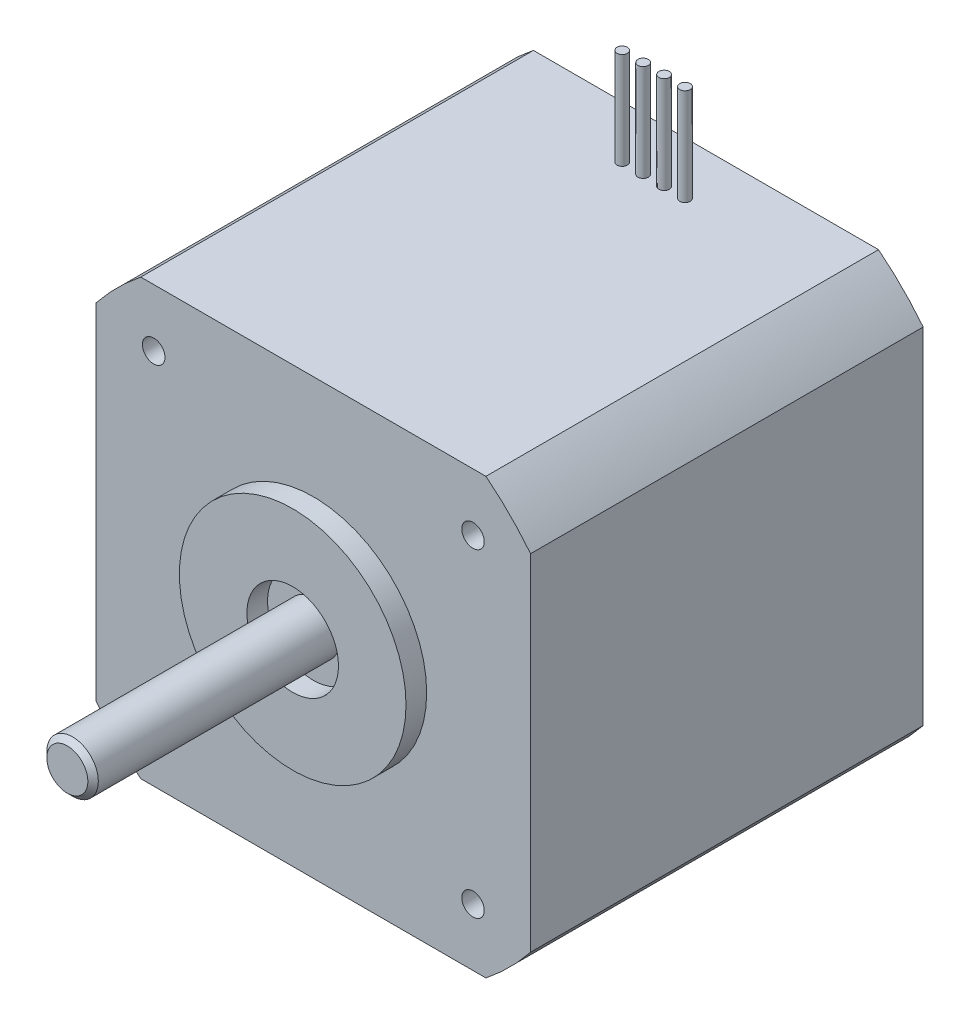
ISO-10303-21;
HEADER;
FILE_DESCRIPTION(('STEP AP214'),'2;1');
FILE_NAME('part.step','',(''),(''),'','','');
FILE_SCHEMA(('AUTOMOTIVE_DESIGN { 1 0 10303 214 1 1 1 1 }'));
ENDSEC;
DATA;
#1=APPLICATION_CONTEXT('core data for automotive mechanical design processes');
#2=APPLICATION_PROTOCOL_DEFINITION('international standard','automotive_design',2000,#1);
#3=PRODUCT_CONTEXT('',#1,'mechanical');
#4=PRODUCT('Part','Part','',(#3));
#5=PRODUCT_RELATED_PRODUCT_CATEGORY('part','',(#4));
#6=PRODUCT_DEFINITION_FORMATION('','',#4);
#7=PRODUCT_DEFINITION_CONTEXT('part definition',#1,'design');
#8=PRODUCT_DEFINITION('design','',#6,#7);
#9=PRODUCT_DEFINITION_SHAPE('','',#8);
#10=(LENGTH_UNIT() NAMED_UNIT(*) SI_UNIT(.MILLI.,.METRE.));
#11=(NAMED_UNIT(*) PLANE_ANGLE_UNIT() SI_UNIT($,.RADIAN.));
#12=(NAMED_UNIT(*) SI_UNIT($,.STERADIAN.) SOLID_ANGLE_UNIT());
#13=UNCERTAINTY_MEASURE_WITH_UNIT(LENGTH_MEASURE(1.E-05),#10,'distance_accuracy_value','');
#14=(GEOMETRIC_REPRESENTATION_CONTEXT(3) GLOBAL_UNCERTAINTY_ASSIGNED_CONTEXT((#13)) GLOBAL_UNIT_ASSIGNED_CONTEXT((#10,
#11,#12)) REPRESENTATION_CONTEXT('',''));
#15=CARTESIAN_POINT('',(0.,0.,0.));
#16=DIRECTION('',(0.,0.,1.));
#17=DIRECTION('',(1.,0.,0.));
#18=AXIS2_PLACEMENT_3D('',#15,#16,#17);
#19=CARTESIAN_POINT('',(0.,0.,0.));
#20=DIRECTION('',(0.,0.,-1.));
#21=DIRECTION('',(-1.,0.,0.));
#22=AXIS2_PLACEMENT_3D('',#19,#20,#21);
#23=CYLINDRICAL_SURFACE('',#22,2.49936000026224);
#24=CARTESIAN_POINT('',(0.,0.,0.));
#25=DIRECTION('',(0.,0.,-1.));
#26=DIRECTION('',(-1.,0.,0.));
#27=AXIS2_PLACEMENT_3D('',#24,#25,#26);
#28=CIRCLE('',#27,2.49936000026224);
#29=CARTESIAN_POINT('',(-2.49936000026224,0.,0.));
#30=VERTEX_POINT('',#29);
#31=EDGE_CURVE('P0_E10',#30,#30,#28,.T.);
#32=ORIENTED_EDGE('',*,*,#31,.T.);
#33=EDGE_LOOP('',(#32));
#34=FACE_BOUND('',#33,.T.);
#35=CARTESIAN_POINT('',(0.,0.,-12.4460000000556));
#36=DIRECTION('',(0.,0.,-1.));
#37=DIRECTION('',(-1.,0.,0.));
#38=AXIS2_PLACEMENT_3D('',#35,#36,#37);
#39=CIRCLE('',#38,2.49936000026224);
#40=CARTESIAN_POINT('',(-2.49936000026224,0.,-12.4460000000556));
#41=VERTEX_POINT('',#40);
#42=EDGE_CURVE('P0_E41',#41,#41,#39,.T.);
#43=ORIENTED_EDGE('',*,*,#42,.F.);
#44=EDGE_LOOP('',(#43));
#45=FACE_BOUND('',#44,.T.);
#46=ADVANCED_FACE('P0_F31',(#34,#45),#23,.T.);
#47=CARTESIAN_POINT('',(2.49936000026224,0.,0.));
#48=DIRECTION('',(0.,0.,1.));
#49=DIRECTION('',(1.,0.,0.));
#50=AXIS2_PLACEMENT_3D('',#47,#48,#49);
#51=PLANE('',#50);
#52=ORIENTED_EDGE('',*,*,#31,.F.);
#53=EDGE_LOOP('',(#52));
#54=FACE_BOUND('',#53,.T.);
#55=ADVANCED_FACE('P0_F52',(#54),#51,.T.);
#56=CARTESIAN_POINT('',(0.,0.,-12.954));
#57=DIRECTION('',(0.,0.,-1.));
#58=DIRECTION('',(-1.,0.,0.));
#59=AXIS2_PLACEMENT_3D('',#56,#57,#58);
#60=PLANE('',#59);
#61=CARTESIAN_POINT('',(0.,0.,-12.954));
#62=DIRECTION('',(0.,0.,-1.));
#63=DIRECTION('',(-1.,0.,0.));
#64=AXIS2_PLACEMENT_3D('',#61,#62,#63);
#65=CIRCLE('',#64,1.99136000031786);
#66=CARTESIAN_POINT('',(-1.99136000031786,0.,-12.954));
#67=VERTEX_POINT('',#66);
#68=EDGE_CURVE('P0_E37',#67,#67,#65,.T.);
#69=ORIENTED_EDGE('',*,*,#68,.T.);
#70=EDGE_LOOP('',(#69));
#71=FACE_BOUND('',#70,.T.);
#72=ADVANCED_FACE('P0_F56',(#71),#60,.T.);
#73=CARTESIAN_POINT('',(0.,0.,-12.954));
#74=DIRECTION('',(0.,0.,1.));
#75=DIRECTION('',(1.,0.,0.));
#76=AXIS2_PLACEMENT_3D('',#73,#74,#75);
#77=CONICAL_SURFACE('',#76,1.99136000031786,0.785398163397448);
#78=ORIENTED_EDGE('',*,*,#42,.T.);
#79=EDGE_LOOP('',(#78));
#80=FACE_BOUND('',#79,.T.);
#81=ORIENTED_EDGE('',*,*,#68,.F.);
#82=EDGE_LOOP('',(#81));
#83=FACE_BOUND('',#82,.T.);
#84=ADVANCED_FACE('P0_F48',(#80,#83),#77,.T.);
#85=CLOSED_SHELL('',(#46,#55,#72,#84));
#86=MANIFOLD_SOLID_BREP('P0_B2',#85);
#87=CARTESIAN_POINT('',(0.,0.,61.976));
#88=DIRECTION('',(0.,0.,-1.));
#89=DIRECTION('',(-1.,0.,0.));
#90=AXIS2_PLACEMENT_3D('',#87,#88,#89);
#91=PLANE('',#90);
#92=CARTESIAN_POINT('',(0.,0.,61.9760000002429));
#93=DIRECTION('',(0.,0.,-1.));
#94=DIRECTION('',(-1.,0.,0.));
#95=AXIS2_PLACEMENT_3D('',#92,#93,#94);
#96=CIRCLE('',#95,1.99136000026101);
#97=CARTESIAN_POINT('',(-1.99136000026101,0.,61.9760000002429));
#98=VERTEX_POINT('',#97);
#99=EDGE_CURVE('P1_E19',#98,#98,#96,.T.);
#100=ORIENTED_EDGE('',*,*,#99,.F.);
#101=EDGE_LOOP('',(#100));
#102=FACE_BOUND('',#101,.T.);
#103=ADVANCED_FACE('P1_F16',(#102),#91,.F.);
#104=CARTESIAN_POINT('',(0.,0.,61.4679999998202));
#105=DIRECTION('',(0.,0.,-1.));
#106=DIRECTION('',(-1.,0.,0.));
#107=AXIS2_PLACEMENT_3D('',#104,#105,#106);
#108=CONICAL_SURFACE('',#107,2.49935999977424,0.785398162502276);
#109=ORIENTED_EDGE('',*,*,#99,.T.);
#110=EDGE_LOOP('',(#109));
#111=FACE_BOUND('',#110,.T.);
#112=CARTESIAN_POINT('',(0.,0.,61.468));
#113=DIRECTION('',(0.,0.,1.));
#114=DIRECTION('',(1.,0.,0.));
#115=AXIS2_PLACEMENT_3D('',#112,#113,#114);
#116=CIRCLE('',#115,2.49936);
#117=CARTESIAN_POINT('',(2.49936,0.,61.468));
#118=VERTEX_POINT('',#117);
#119=EDGE_CURVE('P1_E120',#118,#118,#116,.F.);
#120=ORIENTED_EDGE('',*,*,#119,.F.);
#121=EDGE_LOOP('',(#120));
#122=FACE_BOUND('',#121,.T.);
#123=ADVANCED_FACE('P1_F210',(#111,#122),#108,.T.);
#124=CARTESIAN_POINT('',(0.,0.,38.1));
#125=DIRECTION('',(0.,0.,1.));
#126=DIRECTION('',(1.,0.,0.));
#127=AXIS2_PLACEMENT_3D('',#124,#125,#126);
#128=CYLINDRICAL_SURFACE('',#127,2.49936);
#129=ORIENTED_EDGE('',*,*,#119,.T.);
#130=EDGE_LOOP('',(#129));
#131=FACE_BOUND('',#130,.T.);
#132=CARTESIAN_POINT('',(0.,0.,38.1));
#133=DIRECTION('',(0.,0.,1.));
#134=DIRECTION('',(1.,0.,0.));
#135=AXIS2_PLACEMENT_3D('',#132,#133,#134);
#136=CIRCLE('',#135,2.49936);
#137=CARTESIAN_POINT('',(2.49936,0.,38.1));
#138=VERTEX_POINT('',#137);
#139=EDGE_CURVE('P1_E122',#138,#138,#136,.F.);
#140=ORIENTED_EDGE('',*,*,#139,.F.);
#141=EDGE_LOOP('',(#140));
#142=FACE_BOUND('',#141,.T.);
#143=ADVANCED_FACE('P1_F208',(#131,#142),#128,.T.);
#144=CARTESIAN_POINT('',(0.,0.,38.1));
#145=DIRECTION('',(0.,0.,1.));
#146=DIRECTION('',(1.,0.,0.));
#147=AXIS2_PLACEMENT_3D('',#144,#145,#146);
#148=PLANE('',#147);
#149=ORIENTED_EDGE('',*,*,#139,.T.);
#150=EDGE_LOOP('',(#149));
#151=FACE_BOUND('',#150,.T.);
#152=CARTESIAN_POINT('',(0.,0.,38.1));
#153=DIRECTION('',(0.,0.,1.));
#154=DIRECTION('',(1.,0.,0.));
#155=AXIS2_PLACEMENT_3D('',#152,#153,#154);
#156=CIRCLE('',#155,4.445);
#157=CARTESIAN_POINT('',(4.445,0.,38.1));
#158=VERTEX_POINT('',#157);
#159=EDGE_CURVE('P1_E200',#158,#158,#156,.T.);
#160=ORIENTED_EDGE('',*,*,#159,.T.);
#161=EDGE_LOOP('',(#160));
#162=FACE_BOUND('',#161,.T.);
#163=ADVANCED_FACE('P1_F205',(#151,#162),#148,.T.);
#164=CARTESIAN_POINT('',(0.,0.,38.1));
#165=DIRECTION('',(0.,0.,1.));
#166=DIRECTION('',(1.,0.,0.));
#167=AXIS2_PLACEMENT_3D('',#164,#165,#166);
#168=CYLINDRICAL_SURFACE('',#167,4.445);
#169=CARTESIAN_POINT('',(0.,0.,40.1066));
#170=DIRECTION('',(0.,0.,1.));
#171=DIRECTION('',(1.,0.,0.));
#172=AXIS2_PLACEMENT_3D('',#169,#170,#171);
#173=CIRCLE('',#172,4.445);
#174=CARTESIAN_POINT('',(4.445,0.,40.1066));
#175=VERTEX_POINT('',#174);
#176=EDGE_CURVE('P1_E197',#175,#175,#173,.T.);
#177=ORIENTED_EDGE('',*,*,#176,.T.);
#178=EDGE_LOOP('',(#177));
#179=FACE_BOUND('',#178,.T.);
#180=ORIENTED_EDGE('',*,*,#159,.F.);
#181=EDGE_LOOP('',(#180));
#182=FACE_BOUND('',#181,.T.);
#183=ADVANCED_FACE('P1_F219',(#179,#182),#168,.F.);
#184=CARTESIAN_POINT('',(-15.494,15.494,27.94));
#185=DIRECTION('',(0.,0.,-1.));
#186=DIRECTION('',(-1.,0.,0.));
#187=AXIS2_PLACEMENT_3D('',#184,#185,#186);
#188=PLANE('',#187);
#189=CARTESIAN_POINT('',(-15.494,15.494,27.94));
#190=DIRECTION('',(0.,0.,-1.));
#191=DIRECTION('',(-1.,0.,0.));
#192=AXIS2_PLACEMENT_3D('',#189,#190,#191);
#193=CIRCLE('',#192,1.0922);
#194=CARTESIAN_POINT('',(-16.5862,15.494,27.94));
#195=VERTEX_POINT('',#194);
#196=EDGE_CURVE('P1_E194',#195,#195,#193,.F.);
#197=ORIENTED_EDGE('',*,*,#196,.T.);
#198=EDGE_LOOP('',(#197));
#199=FACE_BOUND('',#198,.T.);
#200=ADVANCED_FACE('P1_F337',(#199),#188,.F.);
#201=CARTESIAN_POINT('',(-15.494,-15.494,27.94));
#202=DIRECTION('',(0.,0.,-1.));
#203=DIRECTION('',(-1.,0.,0.));
#204=AXIS2_PLACEMENT_3D('',#201,#202,#203);
#205=PLANE('',#204);
#206=CARTESIAN_POINT('',(-15.494,-15.494,27.94));
#207=DIRECTION('',(0.,0.,-1.));
#208=DIRECTION('',(-1.,0.,0.));
#209=AXIS2_PLACEMENT_3D('',#206,#207,#208);
#210=CIRCLE('',#209,1.0922);
#211=CARTESIAN_POINT('',(-16.5862,-15.494,27.94));
#212=VERTEX_POINT('',#211);
#213=EDGE_CURVE('P1_E191',#212,#212,#210,.F.);
#214=ORIENTED_EDGE('',*,*,#213,.T.);
#215=EDGE_LOOP('',(#214));
#216=FACE_BOUND('',#215,.T.);
#217=ADVANCED_FACE('P1_F333',(#216),#205,.F.);
#218=CARTESIAN_POINT('',(15.494,-15.494,27.94));
#219=DIRECTION('',(0.,0.,-1.));
#220=DIRECTION('',(-1.,0.,0.));
#221=AXIS2_PLACEMENT_3D('',#218,#219,#220);
#222=PLANE('',#221);
#223=CARTESIAN_POINT('',(15.494,-15.494,27.94));
#224=DIRECTION('',(0.,0.,-1.));
#225=DIRECTION('',(-1.,0.,0.));
#226=AXIS2_PLACEMENT_3D('',#223,#224,#225);
#227=CIRCLE('',#226,1.0922);
#228=CARTESIAN_POINT('',(14.4018,-15.494,27.94));
#229=VERTEX_POINT('',#228);
#230=EDGE_CURVE('P1_E188',#229,#229,#227,.F.);
#231=ORIENTED_EDGE('',*,*,#230,.T.);
#232=EDGE_LOOP('',(#231));
#233=FACE_BOUND('',#232,.T.);
#234=ADVANCED_FACE('P1_F329',(#233),#222,.F.);
#235=CARTESIAN_POINT('',(15.494,15.494,27.94));
#236=DIRECTION('',(0.,0.,-1.));
#237=DIRECTION('',(-1.,0.,0.));
#238=AXIS2_PLACEMENT_3D('',#235,#236,#237);
#239=PLANE('',#238);
#240=CARTESIAN_POINT('',(15.494,15.494,27.94));
#241=DIRECTION('',(0.,0.,-1.));
#242=DIRECTION('',(-1.,0.,0.));
#243=AXIS2_PLACEMENT_3D('',#240,#241,#242);
#244=CIRCLE('',#243,1.0922);
#245=CARTESIAN_POINT('',(14.4018,15.494,27.94));
#246=VERTEX_POINT('',#245);
#247=EDGE_CURVE('P1_E185',#246,#246,#244,.F.);
#248=ORIENTED_EDGE('',*,*,#247,.T.);
#249=EDGE_LOOP('',(#248));
#250=FACE_BOUND('',#249,.T.);
#251=ADVANCED_FACE('P1_F325',(#250),#239,.F.);
#252=CARTESIAN_POINT('',(0.,0.,40.1066));
#253=DIRECTION('',(0.,0.,-1.));
#254=DIRECTION('',(-1.,0.,0.));
#255=AXIS2_PLACEMENT_3D('',#252,#253,#254);
#256=PLANE('',#255);
#257=ORIENTED_EDGE('',*,*,#176,.F.);
#258=EDGE_LOOP('',(#257));
#259=FACE_BOUND('',#258,.T.);
#260=CARTESIAN_POINT('',(0.,0.,40.1066));
#261=DIRECTION('',(0.,0.,1.));
#262=DIRECTION('',(1.,0.,0.));
#263=AXIS2_PLACEMENT_3D('',#260,#261,#262);
#264=CIRCLE('',#263,10.9982);
#265=CARTESIAN_POINT('',(10.9982,0.,40.1066));
#266=VERTEX_POINT('',#265);
#267=EDGE_CURVE('P1_E182',#266,#266,#264,.F.);
#268=ORIENTED_EDGE('',*,*,#267,.F.);
#269=EDGE_LOOP('',(#268));
#270=FACE_BOUND('',#269,.T.);
#271=ADVANCED_FACE('P1_F321',(#259,#270),#256,.F.);
#272=CARTESIAN_POINT('',(-1.016,30.48,5.08));
#273=DIRECTION('',(0.,-1.,0.));
#274=DIRECTION('',(0.,0.,-1.));
#275=AXIS2_PLACEMENT_3D('',#272,#273,#274);
#276=PLANE('',#275);
#277=CARTESIAN_POINT('',(-1.016,30.48,5.08));
#278=DIRECTION('',(0.,1.,0.));
#279=DIRECTION('',(0.,0.,1.));
#280=AXIS2_PLACEMENT_3D('',#277,#278,#279);
#281=CIRCLE('',#280,0.508);
#282=CARTESIAN_POINT('',(-1.016,30.48,5.588));
#283=VERTEX_POINT('',#282);
#284=EDGE_CURVE('P1_E179',#283,#283,#281,.F.);
#285=ORIENTED_EDGE('',*,*,#284,.F.);
#286=EDGE_LOOP('',(#285));
#287=FACE_BOUND('',#286,.T.);
#288=ADVANCED_FACE('P1_F317',(#287),#276,.F.);
#289=CARTESIAN_POINT('',(3.048,30.48,5.08));
#290=DIRECTION('',(0.,-1.,0.));
#291=DIRECTION('',(0.,0.,-1.));
#292=AXIS2_PLACEMENT_3D('',#289,#290,#291);
#293=PLANE('',#292);
#294=CARTESIAN_POINT('',(3.048,30.48,5.08));
#295=DIRECTION('',(0.,1.,0.));
#296=DIRECTION('',(0.,0.,1.));
#297=AXIS2_PLACEMENT_3D('',#294,#295,#296);
#298=CIRCLE('',#297,0.508);
#299=CARTESIAN_POINT('',(3.048,30.48,5.588));
#300=VERTEX_POINT('',#299);
#301=EDGE_CURVE('P1_E176',#300,#300,#298,.F.);
#302=ORIENTED_EDGE('',*,*,#301,.F.);
#303=EDGE_LOOP('',(#302));
#304=FACE_BOUND('',#303,.T.);
#305=ADVANCED_FACE('P1_F313',(#304),#293,.F.);
#306=CARTESIAN_POINT('',(1.016,30.48,5.08));
#307=DIRECTION('',(0.,-1.,0.));
#308=DIRECTION('',(0.,0.,-1.));
#309=AXIS2_PLACEMENT_3D('',#306,#307,#308);
#310=PLANE('',#309);
#311=CARTESIAN_POINT('',(1.016,30.48,5.08));
#312=DIRECTION('',(0.,1.,0.));
#313=DIRECTION('',(0.,0.,1.));
#314=AXIS2_PLACEMENT_3D('',#311,#312,#313);
#315=CIRCLE('',#314,0.508);
#316=CARTESIAN_POINT('',(1.016,30.48,5.588));
#317=VERTEX_POINT('',#316);
#318=EDGE_CURVE('P1_E173',#317,#317,#315,.F.);
#319=ORIENTED_EDGE('',*,*,#318,.F.);
#320=EDGE_LOOP('',(#319));
#321=FACE_BOUND('',#320,.T.);
#322=ADVANCED_FACE('P1_F309',(#321),#310,.F.);
#323=CARTESIAN_POINT('',(-3.048,30.48,5.08));
#324=DIRECTION('',(0.,-1.,0.));
#325=DIRECTION('',(0.,0.,-1.));
#326=AXIS2_PLACEMENT_3D('',#323,#324,#325);
#327=PLANE('',#326);
#328=CARTESIAN_POINT('',(-3.048,30.48,5.08));
#329=DIRECTION('',(0.,1.,0.));
#330=DIRECTION('',(0.,0.,1.));
#331=AXIS2_PLACEMENT_3D('',#328,#329,#330);
#332=CIRCLE('',#331,0.508);
#333=CARTESIAN_POINT('',(-3.048,30.48,5.588));
#334=VERTEX_POINT('',#333);
#335=EDGE_CURVE('P1_E170',#334,#334,#332,.F.);
#336=ORIENTED_EDGE('',*,*,#335,.F.);
#337=EDGE_LOOP('',(#336));
#338=FACE_BOUND('',#337,.T.);
#339=ADVANCED_FACE('P1_F305',(#338),#327,.F.);
#340=CARTESIAN_POINT('',(-15.494,15.494,40.64));
#341=DIRECTION('',(0.,0.,-1.));
#342=DIRECTION('',(-1.,0.,0.));
#343=AXIS2_PLACEMENT_3D('',#340,#341,#342);
#344=CYLINDRICAL_SURFACE('',#343,1.0922);
#345=ORIENTED_EDGE('',*,*,#196,.F.);
#346=EDGE_LOOP('',(#345));
#347=FACE_BOUND('',#346,.T.);
#348=CARTESIAN_POINT('',(-15.494,15.494,38.1));
#349=DIRECTION('',(0.,0.,-1.));
#350=DIRECTION('',(-1.,0.,0.));
#351=AXIS2_PLACEMENT_3D('',#348,#349,#350);
#352=CIRCLE('',#351,1.0922);
#353=CARTESIAN_POINT('',(-16.5862,15.494,38.1));
#354=VERTEX_POINT('',#353);
#355=EDGE_CURVE('P1_E167',#354,#354,#352,.T.);
#356=ORIENTED_EDGE('',*,*,#355,.F.);
#357=EDGE_LOOP('',(#356));
#358=FACE_BOUND('',#357,.T.);
#359=ADVANCED_FACE('P1_F301',(#347,#358),#344,.F.);
#360=CARTESIAN_POINT('',(-15.494,-15.494,40.64));
#361=DIRECTION('',(0.,0.,-1.));
#362=DIRECTION('',(-1.,0.,0.));
#363=AXIS2_PLACEMENT_3D('',#360,#361,#362);
#364=CYLINDRICAL_SURFACE('',#363,1.0922);
#365=ORIENTED_EDGE('',*,*,#213,.F.);
#366=EDGE_LOOP('',(#365));
#367=FACE_BOUND('',#366,.T.);
#368=CARTESIAN_POINT('',(-15.494,-15.494,38.1));
#369=DIRECTION('',(0.,0.,-1.));
#370=DIRECTION('',(-1.,0.,0.));
#371=AXIS2_PLACEMENT_3D('',#368,#369,#370);
#372=CIRCLE('',#371,1.0922);
#373=CARTESIAN_POINT('',(-16.5862,-15.494,38.1));
#374=VERTEX_POINT('',#373);
#375=EDGE_CURVE('P1_E164',#374,#374,#372,.T.);
#376=ORIENTED_EDGE('',*,*,#375,.F.);
#377=EDGE_LOOP('',(#376));
#378=FACE_BOUND('',#377,.T.);
#379=ADVANCED_FACE('P1_F297',(#367,#378),#364,.F.);
#380=CARTESIAN_POINT('',(15.494,-15.494,40.64));
#381=DIRECTION('',(0.,0.,-1.));
#382=DIRECTION('',(-1.,0.,0.));
#383=AXIS2_PLACEMENT_3D('',#380,#381,#382);
#384=CYLINDRICAL_SURFACE('',#383,1.0922);
#385=ORIENTED_EDGE('',*,*,#230,.F.);
#386=EDGE_LOOP('',(#385));
#387=FACE_BOUND('',#386,.T.);
#388=CARTESIAN_POINT('',(15.494,-15.494,38.1));
#389=DIRECTION('',(0.,0.,-1.));
#390=DIRECTION('',(-1.,0.,0.));
#391=AXIS2_PLACEMENT_3D('',#388,#389,#390);
#392=CIRCLE('',#391,1.0922);
#393=CARTESIAN_POINT('',(14.4018,-15.494,38.1));
#394=VERTEX_POINT('',#393);
#395=EDGE_CURVE('P1_E161',#394,#394,#392,.T.);
#396=ORIENTED_EDGE('',*,*,#395,.F.);
#397=EDGE_LOOP('',(#396));
#398=FACE_BOUND('',#397,.T.);
#399=ADVANCED_FACE('P1_F293',(#387,#398),#384,.F.);
#400=CARTESIAN_POINT('',(15.494,15.494,40.64));
#401=DIRECTION('',(0.,0.,-1.));
#402=DIRECTION('',(-1.,0.,0.));
#403=AXIS2_PLACEMENT_3D('',#400,#401,#402);
#404=CYLINDRICAL_SURFACE('',#403,1.0922);
#405=ORIENTED_EDGE('',*,*,#247,.F.);
#406=EDGE_LOOP('',(#405));
#407=FACE_BOUND('',#406,.T.);
#408=CARTESIAN_POINT('',(15.494,15.494,38.1));
#409=DIRECTION('',(0.,0.,-1.));
#410=DIRECTION('',(-1.,0.,0.));
#411=AXIS2_PLACEMENT_3D('',#408,#409,#410);
#412=CIRCLE('',#411,1.0922);
#413=CARTESIAN_POINT('',(14.4018,15.494,38.1));
#414=VERTEX_POINT('',#413);
#415=EDGE_CURVE('P1_E158',#414,#414,#412,.T.);
#416=ORIENTED_EDGE('',*,*,#415,.F.);
#417=EDGE_LOOP('',(#416));
#418=FACE_BOUND('',#417,.T.);
#419=ADVANCED_FACE('P1_F289',(#407,#418),#404,.F.);
#420=CARTESIAN_POINT('',(0.,0.,38.1));
#421=DIRECTION('',(0.,0.,1.));
#422=DIRECTION('',(1.,0.,0.));
#423=AXIS2_PLACEMENT_3D('',#420,#421,#422);
#424=CYLINDRICAL_SURFACE('',#423,10.9982);
#425=ORIENTED_EDGE('',*,*,#267,.T.);
#426=EDGE_LOOP('',(#425));
#427=FACE_BOUND('',#426,.T.);
#428=CARTESIAN_POINT('',(0.,0.,38.1));
#429=DIRECTION('',(0.,0.,1.));
#430=DIRECTION('',(1.,0.,0.));
#431=AXIS2_PLACEMENT_3D('',#428,#429,#430);
#432=CIRCLE('',#431,10.9982);
#433=CARTESIAN_POINT('',(10.9982,0.,38.1));
#434=VERTEX_POINT('',#433);
#435=EDGE_CURVE('P1_E99',#434,#434,#432,.F.);
#436=ORIENTED_EDGE('',*,*,#435,.F.);
#437=EDGE_LOOP('',(#436));
#438=FACE_BOUND('',#437,.T.);
#439=ADVANCED_FACE('P1_F285',(#427,#438),#424,.T.);
#440=CARTESIAN_POINT('',(-1.016,0.,5.08));
#441=DIRECTION('',(0.,1.,0.));
#442=DIRECTION('',(0.,0.,1.));
#443=AXIS2_PLACEMENT_3D('',#440,#441,#442);
#444=CYLINDRICAL_SURFACE('',#443,0.508);
#445=ORIENTED_EDGE('',*,*,#284,.T.);
#446=EDGE_LOOP('',(#445));
#447=FACE_BOUND('',#446,.T.);
#448=CARTESIAN_POINT('',(-1.016,21.082,5.08));
#449=DIRECTION('',(0.,1.,0.));
#450=DIRECTION('',(0.,0.,1.));
#451=AXIS2_PLACEMENT_3D('',#448,#449,#450);
#452=CIRCLE('',#451,0.508);
#453=CARTESIAN_POINT('',(-1.016,21.082,5.588));
#454=VERTEX_POINT('',#453);
#455=EDGE_CURVE('P1_E116',#454,#454,#452,.F.);
#456=ORIENTED_EDGE('',*,*,#455,.F.);
#457=EDGE_LOOP('',(#456));
#458=FACE_BOUND('',#457,.T.);
#459=ADVANCED_FACE('P1_F281',(#447,#458),#444,.T.);
#460=CARTESIAN_POINT('',(3.048,0.,5.08));
#461=DIRECTION('',(0.,1.,0.));
#462=DIRECTION('',(0.,0.,1.));
#463=AXIS2_PLACEMENT_3D('',#460,#461,#462);
#464=CYLINDRICAL_SURFACE('',#463,0.508);
#465=ORIENTED_EDGE('',*,*,#301,.T.);
#466=EDGE_LOOP('',(#465));
#467=FACE_BOUND('',#466,.T.);
#468=CARTESIAN_POINT('',(3.048,21.082,5.08));
#469=DIRECTION('',(0.,1.,0.));
#470=DIRECTION('',(0.,0.,1.));
#471=AXIS2_PLACEMENT_3D('',#468,#469,#470);
#472=CIRCLE('',#471,0.508);
#473=CARTESIAN_POINT('',(3.048,21.082,5.588));
#474=VERTEX_POINT('',#473);
#475=EDGE_CURVE('P1_E149',#474,#474,#472,.F.);
#476=ORIENTED_EDGE('',*,*,#475,.F.);
#477=EDGE_LOOP('',(#476));
#478=FACE_BOUND('',#477,.T.);
#479=ADVANCED_FACE('P1_F277',(#467,#478),#464,.T.);
#480=CARTESIAN_POINT('',(1.016,0.,5.08));
#481=DIRECTION('',(0.,1.,0.));
#482=DIRECTION('',(0.,0.,1.));
#483=AXIS2_PLACEMENT_3D('',#480,#481,#482);
#484=CYLINDRICAL_SURFACE('',#483,0.508);
#485=ORIENTED_EDGE('',*,*,#318,.T.);
#486=EDGE_LOOP('',(#485));
#487=FACE_BOUND('',#486,.T.);
#488=CARTESIAN_POINT('',(1.016,21.082,5.08));
#489=DIRECTION('',(0.,1.,0.));
#490=DIRECTION('',(0.,0.,1.));
#491=AXIS2_PLACEMENT_3D('',#488,#489,#490);
#492=CIRCLE('',#491,0.508);
#493=CARTESIAN_POINT('',(1.016,21.082,5.588));
#494=VERTEX_POINT('',#493);
#495=EDGE_CURVE('P1_E146',#494,#494,#492,.F.);
#496=ORIENTED_EDGE('',*,*,#495,.F.);
#497=EDGE_LOOP('',(#496));
#498=FACE_BOUND('',#497,.T.);
#499=ADVANCED_FACE('P1_F273',(#487,#498),#484,.T.);
#500=CARTESIAN_POINT('',(-3.048,0.,5.08));
#501=DIRECTION('',(0.,1.,0.));
#502=DIRECTION('',(0.,0.,1.));
#503=AXIS2_PLACEMENT_3D('',#500,#501,#502);
#504=CYLINDRICAL_SURFACE('',#503,0.508);
#505=ORIENTED_EDGE('',*,*,#335,.T.);
#506=EDGE_LOOP('',(#505));
#507=FACE_BOUND('',#506,.T.);
#508=CARTESIAN_POINT('',(-3.048,21.082,5.08));
#509=DIRECTION('',(0.,1.,0.));
#510=DIRECTION('',(0.,0.,1.));
#511=AXIS2_PLACEMENT_3D('',#508,#509,#510);
#512=CIRCLE('',#511,0.508);
#513=CARTESIAN_POINT('',(-3.048,21.082,5.588));
#514=VERTEX_POINT('',#513);
#515=EDGE_CURVE('P1_E143',#514,#514,#512,.F.);
#516=ORIENTED_EDGE('',*,*,#515,.F.);
#517=EDGE_LOOP('',(#516));
#518=FACE_BOUND('',#517,.T.);
#519=ADVANCED_FACE('P1_F269',(#507,#518),#504,.T.);
#520=CARTESIAN_POINT('',(0.,0.,38.1));
#521=DIRECTION('',(0.,0.,1.));
#522=DIRECTION('',(1.,0.,0.));
#523=AXIS2_PLACEMENT_3D('',#520,#521,#522);
#524=PLANE('',#523);
#525=ORIENTED_EDGE('',*,*,#435,.T.);
#526=EDGE_LOOP('',(#525));
#527=FACE_BOUND('',#526,.T.);
#528=ORIENTED_EDGE('',*,*,#415,.T.);
#529=EDGE_LOOP('',(#528));
#530=FACE_BOUND('',#529,.T.);
#531=ORIENTED_EDGE('',*,*,#395,.T.);
#532=EDGE_LOOP('',(#531));
#533=FACE_BOUND('',#532,.T.);
#534=ORIENTED_EDGE('',*,*,#375,.T.);
#535=EDGE_LOOP('',(#534));
#536=FACE_BOUND('',#535,.T.);
#537=ORIENTED_EDGE('',*,*,#355,.T.);
#538=EDGE_LOOP('',(#537));
#539=FACE_BOUND('',#538,.T.);
#540=CARTESIAN_POINT('',(0.,0.,38.1));
#541=DIRECTION('',(0.,0.,1.));
#542=DIRECTION('',(1.,0.,0.));
#543=AXIS2_PLACEMENT_3D('',#540,#541,#542);
#544=CIRCLE('',#543,26.924);
#545=CARTESIAN_POINT('',(-21.082,16.746672863587,38.1));
#546=VERTEX_POINT('',#545);
#547=CARTESIAN_POINT('',(-16.746672863587,21.082,38.1));
#548=VERTEX_POINT('',#547);
#549=EDGE_CURVE('P1_E141',#546,#548,#544,.F.);
#550=ORIENTED_EDGE('',*,*,#549,.F.);
#551=DIRECTION('',(0.,1.,0.));
#552=VECTOR('',#551,1.);
#553=CARTESIAN_POINT('',(-21.082,17.907,38.1));
#554=LINE('',#553,#552);
#555=CARTESIAN_POINT('',(-21.082,-16.746672863587,38.1));
#556=VERTEX_POINT('',#555);
#557=EDGE_CURVE('P1_E109',#556,#546,#554,.T.);
#558=ORIENTED_EDGE('',*,*,#557,.F.);
#559=CARTESIAN_POINT('',(0.,0.,38.1));
#560=DIRECTION('',(0.,0.,1.));
#561=DIRECTION('',(1.,0.,0.));
#562=AXIS2_PLACEMENT_3D('',#559,#560,#561);
#563=CIRCLE('',#562,26.924);
#564=CARTESIAN_POINT('',(-16.746672863587,-21.082,38.1));
#565=VERTEX_POINT('',#564);
#566=EDGE_CURVE('P1_E95',#565,#556,#563,.F.);
#567=ORIENTED_EDGE('',*,*,#566,.F.);
#568=DIRECTION('',(1.,0.,0.));
#569=VECTOR('',#568,1.);
#570=CARTESIAN_POINT('',(-17.907,-21.082,38.1));
#571=LINE('',#570,#569);
#572=CARTESIAN_POINT('',(16.746672863587,-21.082,38.1));
#573=VERTEX_POINT('',#572);
#574=EDGE_CURVE('P1_E89',#573,#565,#571,.F.);
#575=ORIENTED_EDGE('',*,*,#574,.F.);
#576=CARTESIAN_POINT('',(0.,0.,38.1));
#577=DIRECTION('',(0.,0.,1.));
#578=DIRECTION('',(1.,0.,0.));
#579=AXIS2_PLACEMENT_3D('',#576,#577,#578);
#580=CIRCLE('',#579,26.924);
#581=CARTESIAN_POINT('',(21.082,-16.746672863587,38.1));
#582=VERTEX_POINT('',#581);
#583=EDGE_CURVE('P1_E79',#582,#573,#580,.F.);
#584=ORIENTED_EDGE('',*,*,#583,.F.);
#585=DIRECTION('',(0.,1.,0.));
#586=VECTOR('',#585,1.);
#587=CARTESIAN_POINT('',(21.082,-17.907,38.1));
#588=LINE('',#587,#586);
#589=CARTESIAN_POINT('',(21.082,16.746672863587,38.1));
#590=VERTEX_POINT('',#589);
#591=EDGE_CURVE('P1_E105',#590,#582,#588,.F.);
#592=ORIENTED_EDGE('',*,*,#591,.F.);
#593=CARTESIAN_POINT('',(0.,0.,38.1));
#594=DIRECTION('',(0.,0.,1.));
#595=DIRECTION('',(1.,0.,0.));
#596=AXIS2_PLACEMENT_3D('',#593,#594,#595);
#597=CIRCLE('',#596,26.924);
#598=CARTESIAN_POINT('',(16.746672863587,21.082,38.1));
#599=VERTEX_POINT('',#598);
#600=EDGE_CURVE('P1_E119',#599,#590,#597,.F.);
#601=ORIENTED_EDGE('',*,*,#600,.F.);
#602=DIRECTION('',(1.,0.,0.));
#603=VECTOR('',#602,1.);
#604=CARTESIAN_POINT('',(17.907,21.082,38.1));
#605=LINE('',#604,#603);
#606=EDGE_CURVE('P1_E113',#548,#599,#605,.T.);
#607=ORIENTED_EDGE('',*,*,#606,.F.);
#608=EDGE_LOOP('',(#550,#558,#567,#575,#584,#592,#601,#607));
#609=FACE_BOUND('',#608,.T.);
#610=ADVANCED_FACE('P1_F93',(#527,#530,#533,#536,#539,#609),#524,.T.);
#611=CARTESIAN_POINT('',(0.,0.,0.254));
#612=DIRECTION('',(0.,0.,1.));
#613=DIRECTION('',(1.,0.,0.));
#614=AXIS2_PLACEMENT_3D('',#611,#612,#613);
#615=PLANE('',#614);
#616=CARTESIAN_POINT('',(0.,0.,0.253999999999997));
#617=DIRECTION('',(0.,0.,-1.));
#618=DIRECTION('',(-1.,0.,0.));
#619=AXIS2_PLACEMENT_3D('',#616,#617,#618);
#620=CIRCLE('',#619,4.445);
#621=CARTESIAN_POINT('',(-4.445,0.,0.253999999999997));
#622=VERTEX_POINT('',#621);
#623=EDGE_CURVE('P1_E136',#622,#622,#620,.T.);
#624=ORIENTED_EDGE('',*,*,#623,.T.);
#625=EDGE_LOOP('',(#624));
#626=FACE_BOUND('',#625,.T.);
#627=ADVANCED_FACE('P1_F263',(#626),#615,.F.);
#628=CARTESIAN_POINT('',(-17.907,-21.082,38.1));
#629=DIRECTION('',(0.,-1.,0.));
#630=DIRECTION('',(0.,0.,-1.));
#631=AXIS2_PLACEMENT_3D('',#628,#629,#630);
#632=PLANE('',#631);
#633=DIRECTION('',(0.,0.,1.));
#634=VECTOR('',#633,1.);
#635=CARTESIAN_POINT('',(16.746672863587,-21.082,0.));
#636=LINE('',#635,#634);
#637=CARTESIAN_POINT('',(16.746672863587,-21.082,0.));
#638=VERTEX_POINT('',#637);
#639=EDGE_CURVE('P1_E86',#573,#638,#636,.F.);
#640=ORIENTED_EDGE('',*,*,#639,.F.);
#641=ORIENTED_EDGE('',*,*,#574,.T.);
#642=DIRECTION('',(0.,0.,1.));
#643=VECTOR('',#642,1.);
#644=CARTESIAN_POINT('',(-16.746672863587,-21.082,0.));
#645=LINE('',#644,#643);
#646=CARTESIAN_POINT('',(-16.746672863587,-21.082,0.));
#647=VERTEX_POINT('',#646);
#648=EDGE_CURVE('P1_E140',#647,#565,#645,.T.);
#649=ORIENTED_EDGE('',*,*,#648,.F.);
#650=DIRECTION('',(1.,0.,0.));
#651=VECTOR('',#650,1.);
#652=CARTESIAN_POINT('',(0.,-21.082,0.));
#653=LINE('',#652,#651);
#654=EDGE_CURVE('P1_E103',#647,#638,#653,.T.);
#655=ORIENTED_EDGE('',*,*,#654,.T.);
#656=EDGE_LOOP('',(#640,#641,#649,#655));
#657=FACE_BOUND('',#656,.T.);
#658=ADVANCED_FACE('P1_F102',(#657),#632,.T.);
#659=CARTESIAN_POINT('',(0.,0.,0.));
#660=DIRECTION('',(0.,0.,1.));
#661=DIRECTION('',(1.,0.,0.));
#662=AXIS2_PLACEMENT_3D('',#659,#660,#661);
#663=CYLINDRICAL_SURFACE('',#662,26.924);
#664=ORIENTED_EDGE('',*,*,#639,.T.);
#665=CARTESIAN_POINT('',(0.,0.,0.));
#666=DIRECTION('',(0.,0.,1.));
#667=DIRECTION('',(1.,0.,0.));
#668=AXIS2_PLACEMENT_3D('',#665,#666,#667);
#669=CIRCLE('',#668,26.924);
#670=CARTESIAN_POINT('',(21.082,-16.746672863587,0.));
#671=VERTEX_POINT('',#670);
#672=EDGE_CURVE('P1_E134',#638,#671,#669,.T.);
#673=ORIENTED_EDGE('',*,*,#672,.T.);
#674=DIRECTION('',(0.,0.,-1.));
#675=VECTOR('',#674,1.);
#676=CARTESIAN_POINT('',(21.082,-16.746672863587,38.1));
#677=LINE('',#676,#675);
#678=EDGE_CURVE('P1_E88',#582,#671,#677,.T.);
#679=ORIENTED_EDGE('',*,*,#678,.F.);
#680=ORIENTED_EDGE('',*,*,#583,.T.);
#681=EDGE_LOOP('',(#664,#673,#679,#680));
#682=FACE_BOUND('',#681,.T.);
#683=ADVANCED_FACE('P1_F83',(#682),#663,.T.);
#684=CARTESIAN_POINT('',(21.082,-17.907,38.1));
#685=DIRECTION('',(1.,0.,0.));
#686=DIRECTION('',(0.,0.,-1.));
#687=AXIS2_PLACEMENT_3D('',#684,#685,#686);
#688=PLANE('',#687);
#689=DIRECTION('',(0.,0.,1.));
#690=VECTOR('',#689,1.);
#691=CARTESIAN_POINT('',(21.082,16.746672863587,0.));
#692=LINE('',#691,#690);
#693=CARTESIAN_POINT('',(21.082,16.746672863587,0.));
#694=VERTEX_POINT('',#693);
#695=EDGE_CURVE('P1_E154',#590,#694,#692,.F.);
#696=ORIENTED_EDGE('',*,*,#695,.F.);
#697=ORIENTED_EDGE('',*,*,#591,.T.);
#698=ORIENTED_EDGE('',*,*,#678,.T.);
#699=DIRECTION('',(0.,1.,0.));
#700=VECTOR('',#699,1.);
#701=CARTESIAN_POINT('',(21.082,0.,0.));
#702=LINE('',#701,#700);
#703=EDGE_CURVE('P1_E133',#671,#694,#702,.T.);
#704=ORIENTED_EDGE('',*,*,#703,.T.);
#705=EDGE_LOOP('',(#696,#697,#698,#704));
#706=FACE_BOUND('',#705,.T.);
#707=ADVANCED_FACE('P1_F254',(#706),#688,.T.);
#708=CARTESIAN_POINT('',(0.,0.,0.));
#709=DIRECTION('',(0.,0.,1.));
#710=DIRECTION('',(1.,0.,0.));
#711=AXIS2_PLACEMENT_3D('',#708,#709,#710);
#712=CYLINDRICAL_SURFACE('',#711,26.924);
#713=ORIENTED_EDGE('',*,*,#695,.T.);
#714=CARTESIAN_POINT('',(0.,0.,0.));
#715=DIRECTION('',(0.,0.,1.));
#716=DIRECTION('',(1.,0.,0.));
#717=AXIS2_PLACEMENT_3D('',#714,#715,#716);
#718=CIRCLE('',#717,26.924);
#719=CARTESIAN_POINT('',(16.746672863587,21.082,0.));
#720=VERTEX_POINT('',#719);
#721=EDGE_CURVE('P1_E130',#694,#720,#718,.T.);
#722=ORIENTED_EDGE('',*,*,#721,.T.);
#723=DIRECTION('',(0.,0.,1.));
#724=VECTOR('',#723,1.);
#725=CARTESIAN_POINT('',(16.746672863587,21.082,38.1));
#726=LINE('',#725,#724);
#727=EDGE_CURVE('P1_E117',#599,#720,#726,.F.);
#728=ORIENTED_EDGE('',*,*,#727,.F.);
#729=ORIENTED_EDGE('',*,*,#600,.T.);
#730=EDGE_LOOP('',(#713,#722,#728,#729));
#731=FACE_BOUND('',#730,.T.);
#732=ADVANCED_FACE('P1_F250',(#731),#712,.T.);
#733=CARTESIAN_POINT('',(17.907,21.082,38.1));
#734=DIRECTION('',(0.,1.,0.));
#735=DIRECTION('',(0.,0.,1.));
#736=AXIS2_PLACEMENT_3D('',#733,#734,#735);
#737=PLANE('',#736);
#738=ORIENTED_EDGE('',*,*,#515,.T.);
#739=EDGE_LOOP('',(#738));
#740=FACE_BOUND('',#739,.T.);
#741=ORIENTED_EDGE('',*,*,#495,.T.);
#742=EDGE_LOOP('',(#741));
#743=FACE_BOUND('',#742,.T.);
#744=ORIENTED_EDGE('',*,*,#475,.T.);
#745=EDGE_LOOP('',(#744));
#746=FACE_BOUND('',#745,.T.);
#747=ORIENTED_EDGE('',*,*,#455,.T.);
#748=EDGE_LOOP('',(#747));
#749=FACE_BOUND('',#748,.T.);
#750=DIRECTION('',(0.,0.,1.));
#751=VECTOR('',#750,1.);
#752=CARTESIAN_POINT('',(-16.746672863587,21.082,0.));
#753=LINE('',#752,#751);
#754=CARTESIAN_POINT('',(-16.746672863587,21.082,0.));
#755=VERTEX_POINT('',#754);
#756=EDGE_CURVE('P1_E111',#548,#755,#753,.F.);
#757=ORIENTED_EDGE('',*,*,#756,.F.);
#758=ORIENTED_EDGE('',*,*,#606,.T.);
#759=ORIENTED_EDGE('',*,*,#727,.T.);
#760=DIRECTION('',(1.,0.,0.));
#761=VECTOR('',#760,1.);
#762=CARTESIAN_POINT('',(0.,21.082,0.));
#763=LINE('',#762,#761);
#764=EDGE_CURVE('P1_E129',#720,#755,#763,.F.);
#765=ORIENTED_EDGE('',*,*,#764,.T.);
#766=EDGE_LOOP('',(#757,#758,#759,#765));
#767=FACE_BOUND('',#766,.T.);
#768=ADVANCED_FACE('P1_F246',(#740,#743,#746,#749,#767),#737,.T.);
#769=CARTESIAN_POINT('',(0.,0.,0.));
#770=DIRECTION('',(0.,0.,1.));
#771=DIRECTION('',(1.,0.,0.));
#772=AXIS2_PLACEMENT_3D('',#769,#770,#771);
#773=CYLINDRICAL_SURFACE('',#772,26.924);
#774=ORIENTED_EDGE('',*,*,#756,.T.);
#775=CARTESIAN_POINT('',(0.,0.,0.));
#776=DIRECTION('',(0.,0.,1.));
#777=DIRECTION('',(1.,0.,0.));
#778=AXIS2_PLACEMENT_3D('',#775,#776,#777);
#779=CIRCLE('',#778,26.924);
#780=CARTESIAN_POINT('',(-21.082,16.746672863587,0.));
#781=VERTEX_POINT('',#780);
#782=EDGE_CURVE('P1_E126',#755,#781,#779,.T.);
#783=ORIENTED_EDGE('',*,*,#782,.T.);
#784=DIRECTION('',(0.,0.,1.));
#785=VECTOR('',#784,1.);
#786=CARTESIAN_POINT('',(-21.082,16.746672863587,38.1));
#787=LINE('',#786,#785);
#788=EDGE_CURVE('P1_E110',#546,#781,#787,.F.);
#789=ORIENTED_EDGE('',*,*,#788,.F.);
#790=ORIENTED_EDGE('',*,*,#549,.T.);
#791=EDGE_LOOP('',(#774,#783,#789,#790));
#792=FACE_BOUND('',#791,.T.);
#793=ADVANCED_FACE('P1_F242',(#792),#773,.T.);
#794=CARTESIAN_POINT('',(-21.082,17.907,38.1));
#795=DIRECTION('',(-1.,0.,0.));
#796=DIRECTION('',(0.,0.,1.));
#797=AXIS2_PLACEMENT_3D('',#794,#795,#796);
#798=PLANE('',#797);
#799=ORIENTED_EDGE('',*,*,#788,.T.);
#800=DIRECTION('',(0.,1.,0.));
#801=VECTOR('',#800,1.);
#802=CARTESIAN_POINT('',(-21.082,0.,0.));
#803=LINE('',#802,#801);
#804=CARTESIAN_POINT('',(-21.082,-16.746672863587,0.));
#805=VERTEX_POINT('',#804);
#806=EDGE_CURVE('P1_E125',#781,#805,#803,.F.);
#807=ORIENTED_EDGE('',*,*,#806,.T.);
#808=DIRECTION('',(0.,0.,1.));
#809=VECTOR('',#808,1.);
#810=CARTESIAN_POINT('',(-21.082,-16.746672863587,0.));
#811=LINE('',#810,#809);
#812=EDGE_CURVE('P1_E34',#556,#805,#811,.F.);
#813=ORIENTED_EDGE('',*,*,#812,.F.);
#814=ORIENTED_EDGE('',*,*,#557,.T.);
#815=EDGE_LOOP('',(#799,#807,#813,#814));
#816=FACE_BOUND('',#815,.T.);
#817=ADVANCED_FACE('P1_F239',(#816),#798,.T.);
#818=CARTESIAN_POINT('',(0.,0.,0.));
#819=DIRECTION('',(0.,0.,1.));
#820=DIRECTION('',(1.,0.,0.));
#821=AXIS2_PLACEMENT_3D('',#818,#819,#820);
#822=CYLINDRICAL_SURFACE('',#821,26.924);
#823=ORIENTED_EDGE('',*,*,#812,.T.);
#824=CARTESIAN_POINT('',(0.,0.,0.));
#825=DIRECTION('',(0.,0.,1.));
#826=DIRECTION('',(1.,0.,0.));
#827=AXIS2_PLACEMENT_3D('',#824,#825,#826);
#828=CIRCLE('',#827,26.924);
#829=EDGE_CURVE('P1_E25',#805,#647,#828,.T.);
#830=ORIENTED_EDGE('',*,*,#829,.T.);
#831=ORIENTED_EDGE('',*,*,#648,.T.);
#832=ORIENTED_EDGE('',*,*,#566,.T.);
#833=EDGE_LOOP('',(#823,#830,#831,#832));
#834=FACE_BOUND('',#833,.T.);
#835=ADVANCED_FACE('P1_F231',(#834),#822,.T.);
#836=CARTESIAN_POINT('',(0.,0.,38.1));
#837=DIRECTION('',(0.,0.,-1.));
#838=DIRECTION('',(-1.,0.,0.));
#839=AXIS2_PLACEMENT_3D('',#836,#837,#838);
#840=CYLINDRICAL_SURFACE('',#839,4.445);
#841=ORIENTED_EDGE('',*,*,#623,.F.);
#842=EDGE_LOOP('',(#841));
#843=FACE_BOUND('',#842,.T.);
#844=CARTESIAN_POINT('',(0.,0.,0.));
#845=DIRECTION('',(0.,0.,-1.));
#846=DIRECTION('',(-1.,0.,0.));
#847=AXIS2_PLACEMENT_3D('',#844,#845,#846);
#848=CIRCLE('',#847,4.445);
#849=CARTESIAN_POINT('',(-4.445,0.,0.));
#850=VERTEX_POINT('',#849);
#851=EDGE_CURVE('P1_E10',#850,#850,#848,.T.);
#852=ORIENTED_EDGE('',*,*,#851,.T.);
#853=EDGE_LOOP('',(#852));
#854=FACE_BOUND('',#853,.T.);
#855=ADVANCED_FACE('P1_F224',(#843,#854),#840,.F.);
#856=CARTESIAN_POINT('',(0.,0.,0.));
#857=DIRECTION('',(0.,0.,1.));
#858=DIRECTION('',(1.,0.,0.));
#859=AXIS2_PLACEMENT_3D('',#856,#857,#858);
#860=PLANE('',#859);
#861=ORIENTED_EDGE('',*,*,#851,.F.);
#862=EDGE_LOOP('',(#861));
#863=FACE_BOUND('',#862,.T.);
#864=ORIENTED_EDGE('',*,*,#806,.F.);
#865=ORIENTED_EDGE('',*,*,#782,.F.);
#866=ORIENTED_EDGE('',*,*,#764,.F.);
#867=ORIENTED_EDGE('',*,*,#721,.F.);
#868=ORIENTED_EDGE('',*,*,#703,.F.);
#869=ORIENTED_EDGE('',*,*,#672,.F.);
#870=ORIENTED_EDGE('',*,*,#654,.F.);
#871=ORIENTED_EDGE('',*,*,#829,.F.);
#872=EDGE_LOOP('',(#864,#865,#866,#867,#868,#869,#870,#871));
#873=FACE_BOUND('',#872,.T.);
#874=ADVANCED_FACE('P1_F222',(#863,#873),#860,.F.);
#875=CLOSED_SHELL('',(#103,#123,#143,#163,#183,#200,#217,#234,#251,#271,#288,#305,#322,#339,
#359,#379,#399,#419,#439,#459,#479,#499,#519,#610,#627,#658,#683,#707,#732,#768,#793,#817,#835,
#855,#874));
#876=MANIFOLD_SOLID_BREP('P1_B1',#875);
#877=ADVANCED_BREP_SHAPE_REPRESENTATION('',(#18,#86,#876),#14);
#878=SHAPE_DEFINITION_REPRESENTATION(#9,#877);
ENDSEC;
END-ISO-10303-21;
